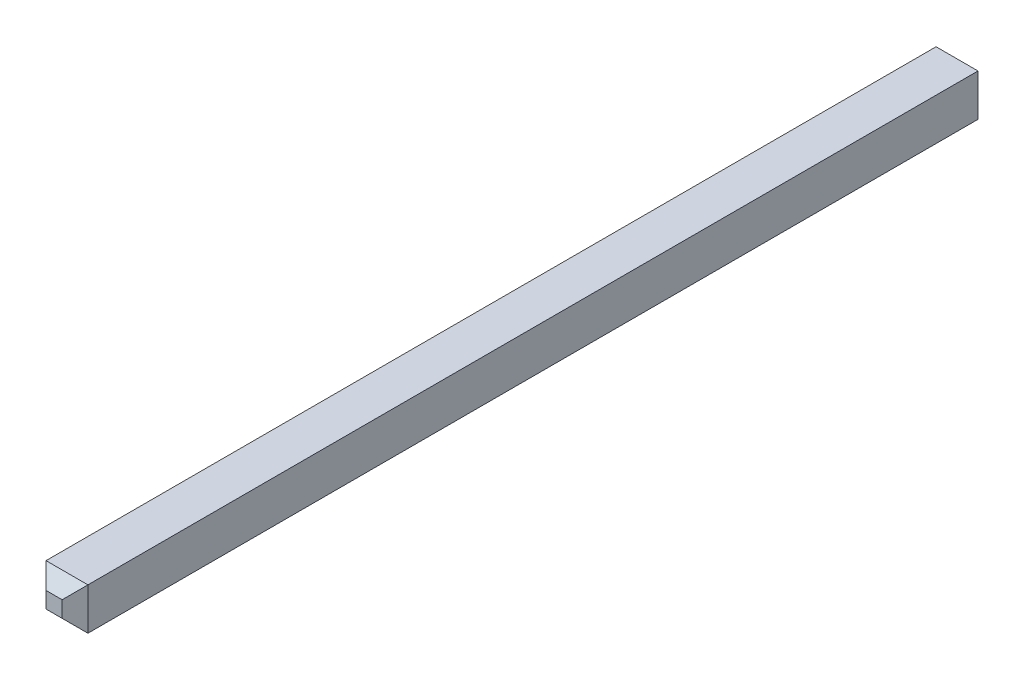
ISO-10303-21;
HEADER;
FILE_DESCRIPTION(('STEP AP214'),'2;1');
FILE_NAME('part.step','',(''),(''),'','','');
FILE_SCHEMA(('AUTOMOTIVE_DESIGN { 1 0 10303 214 1 1 1 1 }'));
ENDSEC;
DATA;
#1=APPLICATION_CONTEXT('core data for automotive mechanical design processes');
#2=APPLICATION_PROTOCOL_DEFINITION('international standard','automotive_design',2000,#1);
#3=PRODUCT_CONTEXT('',#1,'mechanical');
#4=PRODUCT('Part','Part','',(#3));
#5=PRODUCT_RELATED_PRODUCT_CATEGORY('part','',(#4));
#6=PRODUCT_DEFINITION_FORMATION('','',#4);
#7=PRODUCT_DEFINITION_CONTEXT('part definition',#1,'design');
#8=PRODUCT_DEFINITION('design','',#6,#7);
#9=PRODUCT_DEFINITION_SHAPE('','',#8);
#10=(LENGTH_UNIT() NAMED_UNIT(*) SI_UNIT(.MILLI.,.METRE.));
#11=(NAMED_UNIT(*) PLANE_ANGLE_UNIT() SI_UNIT($,.RADIAN.));
#12=(NAMED_UNIT(*) SI_UNIT($,.STERADIAN.) SOLID_ANGLE_UNIT());
#13=UNCERTAINTY_MEASURE_WITH_UNIT(LENGTH_MEASURE(1.E-05),#10,'distance_accuracy_value','');
#14=(GEOMETRIC_REPRESENTATION_CONTEXT(3) GLOBAL_UNCERTAINTY_ASSIGNED_CONTEXT((#13)) GLOBAL_UNIT_ASSIGNED_CONTEXT((#10,
#11,#12)) REPRESENTATION_CONTEXT('',''));
#15=CARTESIAN_POINT('',(0.,0.,0.));
#16=DIRECTION('',(0.,0.,1.));
#17=DIRECTION('',(1.,0.,0.));
#18=AXIS2_PLACEMENT_3D('',#15,#16,#17);
#19=CARTESIAN_POINT('',(-0.225,0.,-0.1));
#20=DIRECTION('',(-0.707106781186548,0.,0.707106781186548));
#21=DIRECTION('',(0.707106781186548,0.,0.707106781186548));
#22=AXIS2_PLACEMENT_3D('',#19,#20,#21);
#23=PLANE('',#22);
#24=DIRECTION('',(0.,1.,0.));
#25=VECTOR('',#24,1.);
#26=CARTESIAN_POINT('',(-0.325,0.325,-0.2));
#27=LINE('',#26,#25);
#28=CARTESIAN_POINT('',(-0.325,-0.325,-0.2));
#29=VERTEX_POINT('',#28);
#30=CARTESIAN_POINT('',(-0.325,0.325,-0.2));
#31=VERTEX_POINT('',#30);
#32=EDGE_CURVE('E96',#29,#31,#27,.T.);
#33=ORIENTED_EDGE('',*,*,#32,.F.);
#34=DIRECTION('',(-0.577350269189626,-0.577350269189626,-0.577350269189626));
#35=VECTOR('',#34,1.);
#36=CARTESIAN_POINT('',(-0.125,-0.125,0.));
#37=LINE('',#36,#35);
#38=CARTESIAN_POINT('',(-0.125,-0.125,0.));
#39=VERTEX_POINT('',#38);
#40=EDGE_CURVE('E94',#39,#29,#37,.T.);
#41=ORIENTED_EDGE('',*,*,#40,.F.);
#42=DIRECTION('',(0.,1.,0.));
#43=VECTOR('',#42,1.);
#44=CARTESIAN_POINT('',(-0.125,0.,0.));
#45=LINE('',#44,#43);
#46=CARTESIAN_POINT('',(-0.125,0.125,0.));
#47=VERTEX_POINT('',#46);
#48=EDGE_CURVE('E20',#47,#39,#45,.F.);
#49=ORIENTED_EDGE('',*,*,#48,.F.);
#50=DIRECTION('',(0.577350269189626,-0.577350269189626,0.577350269189626));
#51=VECTOR('',#50,1.);
#52=CARTESIAN_POINT('',(-0.325,0.325,-0.2));
#53=LINE('',#52,#51);
#54=EDGE_CURVE('E112',#31,#47,#53,.T.);
#55=ORIENTED_EDGE('',*,*,#54,.F.);
#56=EDGE_LOOP('',(#33,#41,#49,#55));
#57=FACE_BOUND('',#56,.T.);
#58=ADVANCED_FACE('F17',(#57),#23,.T.);
#59=CARTESIAN_POINT('',(-0.225,0.,-14.1));
#60=DIRECTION('',(-0.707106781186548,0.,-0.707106781186548));
#61=DIRECTION('',(-0.707106781186548,0.,0.707106781186548));
#62=AXIS2_PLACEMENT_3D('',#59,#60,#61);
#63=PLANE('',#62);
#64=DIRECTION('',(0.,1.,0.));
#65=VECTOR('',#64,1.);
#66=CARTESIAN_POINT('',(-0.125,0.,-14.2));
#67=LINE('',#66,#65);
#68=CARTESIAN_POINT('',(-0.125,0.125,-14.2));
#69=VERTEX_POINT('',#68);
#70=CARTESIAN_POINT('',(-0.125,-0.125,-14.2));
#71=VERTEX_POINT('',#70);
#72=EDGE_CURVE('E79',#69,#71,#67,.F.);
#73=ORIENTED_EDGE('',*,*,#72,.T.);
#74=DIRECTION('',(0.577350269189628,0.577350269189625,-0.577350269189624));
#75=VECTOR('',#74,1.);
#76=CARTESIAN_POINT('',(-0.325,-0.325,-14.));
#77=LINE('',#76,#75);
#78=CARTESIAN_POINT('',(-0.325,-0.325,-14.));
#79=VERTEX_POINT('',#78);
#80=EDGE_CURVE('E106',#79,#71,#77,.T.);
#81=ORIENTED_EDGE('',*,*,#80,.F.);
#82=DIRECTION('',(0.,1.,0.));
#83=VECTOR('',#82,1.);
#84=CARTESIAN_POINT('',(-0.325,0.325,-14.));
#85=LINE('',#84,#83);
#86=CARTESIAN_POINT('',(-0.325,0.325,-14.));
#87=VERTEX_POINT('',#86);
#88=EDGE_CURVE('E121',#87,#79,#85,.F.);
#89=ORIENTED_EDGE('',*,*,#88,.F.);
#90=DIRECTION('',(-0.577350269189628,0.577350269189625,0.577350269189624));
#91=VECTOR('',#90,1.);
#92=CARTESIAN_POINT('',(-0.125,0.125,-14.2));
#93=LINE('',#92,#91);
#94=EDGE_CURVE('E118',#69,#87,#93,.T.);
#95=ORIENTED_EDGE('',*,*,#94,.F.);
#96=EDGE_LOOP('',(#73,#81,#89,#95));
#97=FACE_BOUND('',#96,.T.);
#98=ADVANCED_FACE('F283',(#97),#63,.T.);
#99=CARTESIAN_POINT('',(0.,0.,0.));
#100=DIRECTION('',(0.,0.,1.));
#101=DIRECTION('',(1.,0.,0.));
#102=AXIS2_PLACEMENT_3D('',#99,#100,#101);
#103=PLANE('',#102);
#104=ORIENTED_EDGE('',*,*,#48,.T.);
#105=DIRECTION('',(1.,0.,0.));
#106=VECTOR('',#105,1.);
#107=CARTESIAN_POINT('',(0.,-0.125,0.));
#108=LINE('',#107,#106);
#109=CARTESIAN_POINT('',(0.125,-0.125,0.));
#110=VERTEX_POINT('',#109);
#111=EDGE_CURVE('E88',#110,#39,#108,.F.);
#112=ORIENTED_EDGE('',*,*,#111,.F.);
#113=DIRECTION('',(0.,1.,0.));
#114=VECTOR('',#113,1.);
#115=CARTESIAN_POINT('',(0.125,0.,0.));
#116=LINE('',#115,#114);
#117=CARTESIAN_POINT('',(0.125,0.125,0.));
#118=VERTEX_POINT('',#117);
#119=EDGE_CURVE('E127',#118,#110,#116,.F.);
#120=ORIENTED_EDGE('',*,*,#119,.F.);
#121=DIRECTION('',(1.,0.,0.));
#122=VECTOR('',#121,1.);
#123=CARTESIAN_POINT('',(0.,0.125,0.));
#124=LINE('',#123,#122);
#125=EDGE_CURVE('E90',#47,#118,#124,.T.);
#126=ORIENTED_EDGE('',*,*,#125,.F.);
#127=EDGE_LOOP('',(#104,#112,#120,#126));
#128=FACE_BOUND('',#127,.T.);
#129=ADVANCED_FACE('F85',(#128),#103,.T.);
#130=CARTESIAN_POINT('',(0.,-0.225,-0.1));
#131=DIRECTION('',(0.,-0.707106781186548,0.707106781186548));
#132=DIRECTION('',(0.,-0.707106781186548,-0.707106781186548));
#133=AXIS2_PLACEMENT_3D('',#130,#131,#132);
#134=PLANE('',#133);
#135=ORIENTED_EDGE('',*,*,#111,.T.);
#136=ORIENTED_EDGE('',*,*,#40,.T.);
#137=DIRECTION('',(1.,0.,0.));
#138=VECTOR('',#137,1.);
#139=CARTESIAN_POINT('',(-0.325,-0.325,-0.2));
#140=LINE('',#139,#138);
#141=CARTESIAN_POINT('',(0.325,-0.325,-0.2));
#142=VERTEX_POINT('',#141);
#143=EDGE_CURVE('E130',#142,#29,#140,.F.);
#144=ORIENTED_EDGE('',*,*,#143,.F.);
#145=DIRECTION('',(0.577350269189626,-0.577350269189626,-0.577350269189626));
#146=VECTOR('',#145,1.);
#147=CARTESIAN_POINT('',(0.125,-0.125,0.));
#148=LINE('',#147,#146);
#149=EDGE_CURVE('E102',#110,#142,#148,.T.);
#150=ORIENTED_EDGE('',*,*,#149,.F.);
#151=EDGE_LOOP('',(#135,#136,#144,#150));
#152=FACE_BOUND('',#151,.T.);
#153=ADVANCED_FACE('F100',(#152),#134,.T.);
#154=CARTESIAN_POINT('',(0.,0.,-14.2));
#155=DIRECTION('',(0.,0.,1.));
#156=DIRECTION('',(1.,0.,0.));
#157=AXIS2_PLACEMENT_3D('',#154,#155,#156);
#158=PLANE('',#157);
#159=DIRECTION('',(0.,1.,0.));
#160=VECTOR('',#159,1.);
#161=CARTESIAN_POINT('',(0.125,0.,-14.2));
#162=LINE('',#161,#160);
#163=CARTESIAN_POINT('',(0.125,-0.125,-14.2));
#164=VERTEX_POINT('',#163);
#165=CARTESIAN_POINT('',(0.125,0.125,-14.2));
#166=VERTEX_POINT('',#165);
#167=EDGE_CURVE('E139',#164,#166,#162,.T.);
#168=ORIENTED_EDGE('',*,*,#167,.F.);
#169=DIRECTION('',(1.,0.,0.));
#170=VECTOR('',#169,1.);
#171=CARTESIAN_POINT('',(0.,-0.125,-14.2));
#172=LINE('',#171,#170);
#173=EDGE_CURVE('E109',#71,#164,#172,.T.);
#174=ORIENTED_EDGE('',*,*,#173,.F.);
#175=ORIENTED_EDGE('',*,*,#72,.F.);
#176=DIRECTION('',(1.,0.,0.));
#177=VECTOR('',#176,1.);
#178=CARTESIAN_POINT('',(0.,0.125,-14.2));
#179=LINE('',#178,#177);
#180=EDGE_CURVE('E115',#166,#69,#179,.F.);
#181=ORIENTED_EDGE('',*,*,#180,.F.);
#182=EDGE_LOOP('',(#168,#174,#175,#181));
#183=FACE_BOUND('',#182,.T.);
#184=ADVANCED_FACE('F259',(#183),#158,.F.);
#185=CARTESIAN_POINT('',(0.,-0.225,-14.1));
#186=DIRECTION('',(0.,-0.707106781186548,-0.707106781186548));
#187=DIRECTION('',(0.,0.707106781186548,-0.707106781186548));
#188=AXIS2_PLACEMENT_3D('',#185,#186,#187);
#189=PLANE('',#188);
#190=ORIENTED_EDGE('',*,*,#173,.T.);
#191=DIRECTION('',(-0.577350269189625,0.577350269189628,-0.577350269189624));
#192=VECTOR('',#191,1.);
#193=CARTESIAN_POINT('',(0.325,-0.325,-14.));
#194=LINE('',#193,#192);
#195=CARTESIAN_POINT('',(0.325,-0.325,-14.));
#196=VERTEX_POINT('',#195);
#197=EDGE_CURVE('E144',#196,#164,#194,.T.);
#198=ORIENTED_EDGE('',*,*,#197,.F.);
#199=DIRECTION('',(1.,0.,0.));
#200=VECTOR('',#199,1.);
#201=CARTESIAN_POINT('',(-0.325,-0.325,-14.));
#202=LINE('',#201,#200);
#203=EDGE_CURVE('E136',#79,#196,#202,.T.);
#204=ORIENTED_EDGE('',*,*,#203,.F.);
#205=ORIENTED_EDGE('',*,*,#80,.T.);
#206=EDGE_LOOP('',(#190,#198,#204,#205));
#207=FACE_BOUND('',#206,.T.);
#208=ADVANCED_FACE('F251',(#207),#189,.T.);
#209=CARTESIAN_POINT('',(0.,0.225,-0.1));
#210=DIRECTION('',(0.,0.707106781186548,0.707106781186548));
#211=DIRECTION('',(0.,-0.707106781186548,0.707106781186548));
#212=AXIS2_PLACEMENT_3D('',#209,#210,#211);
#213=PLANE('',#212);
#214=ORIENTED_EDGE('',*,*,#125,.T.);
#215=DIRECTION('',(-0.577350269189626,-0.577350269189626,0.577350269189626));
#216=VECTOR('',#215,1.);
#217=CARTESIAN_POINT('',(0.325,0.325,-0.2));
#218=LINE('',#217,#216);
#219=CARTESIAN_POINT('',(0.325,0.325,-0.2));
#220=VERTEX_POINT('',#219);
#221=EDGE_CURVE('E124',#220,#118,#218,.T.);
#222=ORIENTED_EDGE('',*,*,#221,.F.);
#223=DIRECTION('',(1.,0.,0.));
#224=VECTOR('',#223,1.);
#225=CARTESIAN_POINT('',(0.325,0.325,-0.2));
#226=LINE('',#225,#224);
#227=EDGE_CURVE('E147',#31,#220,#226,.T.);
#228=ORIENTED_EDGE('',*,*,#227,.F.);
#229=ORIENTED_EDGE('',*,*,#54,.T.);
#230=EDGE_LOOP('',(#214,#222,#228,#229));
#231=FACE_BOUND('',#230,.T.);
#232=ADVANCED_FACE('F173',(#231),#213,.T.);
#233=CARTESIAN_POINT('',(0.,0.225,-14.1));
#234=DIRECTION('',(0.,0.707106781186548,-0.707106781186548));
#235=DIRECTION('',(0.,0.707106781186548,0.707106781186548));
#236=AXIS2_PLACEMENT_3D('',#233,#234,#235);
#237=PLANE('',#236);
#238=DIRECTION('',(1.,0.,0.));
#239=VECTOR('',#238,1.);
#240=CARTESIAN_POINT('',(0.325,0.325,-14.));
#241=LINE('',#240,#239);
#242=CARTESIAN_POINT('',(0.325,0.325,-14.));
#243=VERTEX_POINT('',#242);
#244=EDGE_CURVE('E35',#243,#87,#241,.F.);
#245=ORIENTED_EDGE('',*,*,#244,.F.);
#246=DIRECTION('',(0.577350269189625,0.577350269189628,0.577350269189624));
#247=VECTOR('',#246,1.);
#248=CARTESIAN_POINT('',(0.125,0.125,-14.2));
#249=LINE('',#248,#247);
#250=EDGE_CURVE('E142',#166,#243,#249,.T.);
#251=ORIENTED_EDGE('',*,*,#250,.F.);
#252=ORIENTED_EDGE('',*,*,#180,.T.);
#253=ORIENTED_EDGE('',*,*,#94,.T.);
#254=EDGE_LOOP('',(#245,#251,#252,#253));
#255=FACE_BOUND('',#254,.T.);
#256=ADVANCED_FACE('F190',(#255),#237,.T.);
#257=CARTESIAN_POINT('',(-0.325,0.325,0.));
#258=DIRECTION('',(-1.,0.,0.));
#259=DIRECTION('',(0.,0.,1.));
#260=AXIS2_PLACEMENT_3D('',#257,#258,#259);
#261=PLANE('',#260);
#262=ORIENTED_EDGE('',*,*,#88,.T.);
#263=DIRECTION('',(0.,0.,-1.));
#264=VECTOR('',#263,1.);
#265=CARTESIAN_POINT('',(-0.325,-0.325,0.));
#266=LINE('',#265,#264);
#267=EDGE_CURVE('E133',#29,#79,#266,.T.);
#268=ORIENTED_EDGE('',*,*,#267,.F.);
#269=ORIENTED_EDGE('',*,*,#32,.T.);
#270=DIRECTION('',(0.,0.,1.));
#271=VECTOR('',#270,1.);
#272=CARTESIAN_POINT('',(-0.325,0.325,0.));
#273=LINE('',#272,#271);
#274=EDGE_CURVE('E151',#87,#31,#273,.T.);
#275=ORIENTED_EDGE('',*,*,#274,.F.);
#276=EDGE_LOOP('',(#262,#268,#269,#275));
#277=FACE_BOUND('',#276,.T.);
#278=ADVANCED_FACE('F176',(#277),#261,.T.);
#279=CARTESIAN_POINT('',(0.225,0.,-0.1));
#280=DIRECTION('',(0.707106781186548,0.,0.707106781186548));
#281=DIRECTION('',(0.707106781186548,0.,-0.707106781186548));
#282=AXIS2_PLACEMENT_3D('',#279,#280,#281);
#283=PLANE('',#282);
#284=ORIENTED_EDGE('',*,*,#119,.T.);
#285=ORIENTED_EDGE('',*,*,#149,.T.);
#286=DIRECTION('',(0.,1.,0.));
#287=VECTOR('',#286,1.);
#288=CARTESIAN_POINT('',(0.325,-0.325,-0.2));
#289=LINE('',#288,#287);
#290=EDGE_CURVE('E154',#220,#142,#289,.F.);
#291=ORIENTED_EDGE('',*,*,#290,.F.);
#292=ORIENTED_EDGE('',*,*,#221,.T.);
#293=EDGE_LOOP('',(#284,#285,#291,#292));
#294=FACE_BOUND('',#293,.T.);
#295=ADVANCED_FACE('F181',(#294),#283,.T.);
#296=CARTESIAN_POINT('',(-0.325,-0.325,0.));
#297=DIRECTION('',(0.,-1.,0.));
#298=DIRECTION('',(0.,0.,-1.));
#299=AXIS2_PLACEMENT_3D('',#296,#297,#298);
#300=PLANE('',#299);
#301=ORIENTED_EDGE('',*,*,#203,.T.);
#302=DIRECTION('',(0.,0.,-1.));
#303=VECTOR('',#302,1.);
#304=CARTESIAN_POINT('',(0.325,-0.325,0.));
#305=LINE('',#304,#303);
#306=EDGE_CURVE('E157',#142,#196,#305,.T.);
#307=ORIENTED_EDGE('',*,*,#306,.F.);
#308=ORIENTED_EDGE('',*,*,#143,.T.);
#309=ORIENTED_EDGE('',*,*,#267,.T.);
#310=EDGE_LOOP('',(#301,#307,#308,#309));
#311=FACE_BOUND('',#310,.T.);
#312=ADVANCED_FACE('F179',(#311),#300,.T.);
#313=CARTESIAN_POINT('',(0.225,0.,-14.1));
#314=DIRECTION('',(0.707106781186548,0.,-0.707106781186548));
#315=DIRECTION('',(-0.707106781186548,0.,-0.707106781186548));
#316=AXIS2_PLACEMENT_3D('',#313,#314,#315);
#317=PLANE('',#316);
#318=DIRECTION('',(0.,1.,0.));
#319=VECTOR('',#318,1.);
#320=CARTESIAN_POINT('',(0.325,-0.325,-14.));
#321=LINE('',#320,#319);
#322=EDGE_CURVE('E26',#196,#243,#321,.T.);
#323=ORIENTED_EDGE('',*,*,#322,.F.);
#324=ORIENTED_EDGE('',*,*,#197,.T.);
#325=ORIENTED_EDGE('',*,*,#167,.T.);
#326=ORIENTED_EDGE('',*,*,#250,.T.);
#327=EDGE_LOOP('',(#323,#324,#325,#326));
#328=FACE_BOUND('',#327,.T.);
#329=ADVANCED_FACE('F167',(#328),#317,.T.);
#330=CARTESIAN_POINT('',(0.325,0.325,0.));
#331=DIRECTION('',(0.,1.,0.));
#332=DIRECTION('',(0.,0.,1.));
#333=AXIS2_PLACEMENT_3D('',#330,#331,#332);
#334=PLANE('',#333);
#335=ORIENTED_EDGE('',*,*,#244,.T.);
#336=ORIENTED_EDGE('',*,*,#274,.T.);
#337=ORIENTED_EDGE('',*,*,#227,.T.);
#338=DIRECTION('',(0.,0.,-1.));
#339=VECTOR('',#338,1.);
#340=CARTESIAN_POINT('',(0.325,0.325,0.));
#341=LINE('',#340,#339);
#342=EDGE_CURVE('E11',#243,#220,#341,.F.);
#343=ORIENTED_EDGE('',*,*,#342,.F.);
#344=EDGE_LOOP('',(#335,#336,#337,#343));
#345=FACE_BOUND('',#344,.T.);
#346=ADVANCED_FACE('F169',(#345),#334,.T.);
#347=CARTESIAN_POINT('',(0.325,-0.325,0.));
#348=DIRECTION('',(1.,0.,0.));
#349=DIRECTION('',(0.,0.,-1.));
#350=AXIS2_PLACEMENT_3D('',#347,#348,#349);
#351=PLANE('',#350);
#352=ORIENTED_EDGE('',*,*,#322,.T.);
#353=ORIENTED_EDGE('',*,*,#342,.T.);
#354=ORIENTED_EDGE('',*,*,#290,.T.);
#355=ORIENTED_EDGE('',*,*,#306,.T.);
#356=EDGE_LOOP('',(#352,#353,#354,#355));
#357=FACE_BOUND('',#356,.T.);
#358=ADVANCED_FACE('F163',(#357),#351,.T.);
#359=CLOSED_SHELL('',(#58,#98,#129,#153,#184,#208,#232,#256,#278,#295,#312,#329,#346,#358));
#360=MANIFOLD_SOLID_BREP('B1',#359);
#361=ADVANCED_BREP_SHAPE_REPRESENTATION('',(#18,#360),#14);
#362=SHAPE_DEFINITION_REPRESENTATION(#9,#361);
ENDSEC;
END-ISO-10303-21;
